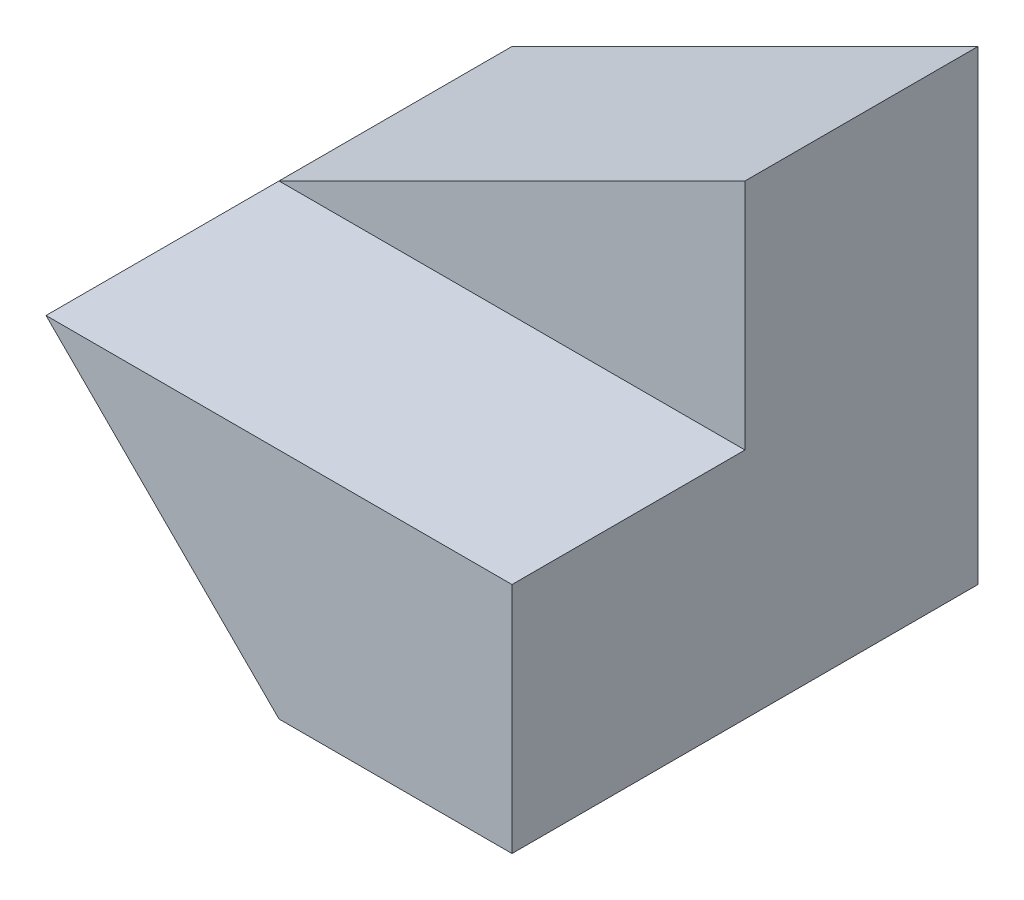
ISO-10303-21;
HEADER;
FILE_DESCRIPTION(('STEP AP214'),'2;1');
FILE_NAME('part.step','',(''),(''),'','','');
FILE_SCHEMA(('AUTOMOTIVE_DESIGN { 1 0 10303 214 1 1 1 1 }'));
ENDSEC;
DATA;
#1=APPLICATION_CONTEXT('core data for automotive mechanical design processes');
#2=APPLICATION_PROTOCOL_DEFINITION('international standard','automotive_design',2000,#1);
#3=PRODUCT_CONTEXT('',#1,'mechanical');
#4=PRODUCT('Part','Part','',(#3));
#5=PRODUCT_RELATED_PRODUCT_CATEGORY('part','',(#4));
#6=PRODUCT_DEFINITION_FORMATION('','',#4);
#7=PRODUCT_DEFINITION_CONTEXT('part definition',#1,'design');
#8=PRODUCT_DEFINITION('design','',#6,#7);
#9=PRODUCT_DEFINITION_SHAPE('','',#8);
#10=(LENGTH_UNIT() NAMED_UNIT(*) SI_UNIT(.MILLI.,.METRE.));
#11=(NAMED_UNIT(*) PLANE_ANGLE_UNIT() SI_UNIT($,.RADIAN.));
#12=(NAMED_UNIT(*) SI_UNIT($,.STERADIAN.) SOLID_ANGLE_UNIT());
#13=UNCERTAINTY_MEASURE_WITH_UNIT(LENGTH_MEASURE(1.E-05),#10,'distance_accuracy_value','');
#14=(GEOMETRIC_REPRESENTATION_CONTEXT(3) GLOBAL_UNCERTAINTY_ASSIGNED_CONTEXT((#13)) GLOBAL_UNIT_ASSIGNED_CONTEXT((#10,
#11,#12)) REPRESENTATION_CONTEXT('',''));
#15=CARTESIAN_POINT('',(0.,0.,0.));
#16=DIRECTION('',(0.,0.,1.));
#17=DIRECTION('',(1.,0.,0.));
#18=AXIS2_PLACEMENT_3D('',#15,#16,#17);
#19=CARTESIAN_POINT('',(0.,0.,40.));
#20=DIRECTION('',(1.,0.,0.));
#21=DIRECTION('',(0.,0.,-1.));
#22=AXIS2_PLACEMENT_3D('',#19,#20,#21);
#23=PLANE('',#22);
#24=DIRECTION('',(0.,-1.,0.));
#25=VECTOR('',#24,1.);
#26=CARTESIAN_POINT('',(0.,0.,20.));
#27=LINE('',#26,#25);
#28=CARTESIAN_POINT('',(0.,20.,20.));
#29=VERTEX_POINT('',#28);
#30=CARTESIAN_POINT('',(0.,0.,20.));
#31=VERTEX_POINT('',#30);
#32=EDGE_CURVE('E125',#29,#31,#27,.T.);
#33=ORIENTED_EDGE('',*,*,#32,.F.);
#34=DIRECTION('',(0.,0.,1.));
#35=VECTOR('',#34,1.);
#36=CARTESIAN_POINT('',(0.,20.,0.));
#37=LINE('',#36,#35);
#38=CARTESIAN_POINT('',(0.,20.,0.));
#39=VERTEX_POINT('',#38);
#40=EDGE_CURVE('E96',#39,#29,#37,.T.);
#41=ORIENTED_EDGE('',*,*,#40,.F.);
#42=DIRECTION('',(0.,-1.,0.));
#43=VECTOR('',#42,1.);
#44=CARTESIAN_POINT('',(0.,0.,0.));
#45=LINE('',#44,#43);
#46=CARTESIAN_POINT('',(0.,0.,0.));
#47=VERTEX_POINT('',#46);
#48=EDGE_CURVE('E73',#39,#47,#45,.T.);
#49=ORIENTED_EDGE('',*,*,#48,.T.);
#50=DIRECTION('',(0.,0.,-1.));
#51=VECTOR('',#50,1.);
#52=CARTESIAN_POINT('',(0.,0.,40.));
#53=LINE('',#52,#51);
#54=EDGE_CURVE('E41',#31,#47,#53,.T.);
#55=ORIENTED_EDGE('',*,*,#54,.F.);
#56=EDGE_LOOP('',(#33,#41,#49,#55));
#57=FACE_BOUND('',#56,.T.);
#58=ADVANCED_FACE('F33',(#57),#23,.F.);
#59=CARTESIAN_POINT('',(0.,0.,40.));
#60=DIRECTION('',(0.,1.,0.));
#61=DIRECTION('',(0.,0.,1.));
#62=AXIS2_PLACEMENT_3D('',#59,#60,#61);
#63=PLANE('',#62);
#64=DIRECTION('',(1.,0.,0.));
#65=VECTOR('',#64,1.);
#66=CARTESIAN_POINT('',(0.,0.,40.));
#67=LINE('',#66,#65);
#68=CARTESIAN_POINT('',(20.,0.,40.));
#69=VERTEX_POINT('',#68);
#70=CARTESIAN_POINT('',(40.,0.,40.));
#71=VERTEX_POINT('',#70);
#72=EDGE_CURVE('E48',#69,#71,#67,.T.);
#73=ORIENTED_EDGE('',*,*,#72,.F.);
#74=DIRECTION('',(0.,0.,1.));
#75=VECTOR('',#74,1.);
#76=CARTESIAN_POINT('',(20.,0.,20.));
#77=LINE('',#76,#75);
#78=CARTESIAN_POINT('',(20.,0.,20.));
#79=VERTEX_POINT('',#78);
#80=EDGE_CURVE('E116',#79,#69,#77,.T.);
#81=ORIENTED_EDGE('',*,*,#80,.F.);
#82=DIRECTION('',(1.,0.,0.));
#83=VECTOR('',#82,1.);
#84=CARTESIAN_POINT('',(20.,0.,20.));
#85=LINE('',#84,#83);
#86=EDGE_CURVE('E128',#31,#79,#85,.T.);
#87=ORIENTED_EDGE('',*,*,#86,.F.);
#88=ORIENTED_EDGE('',*,*,#54,.T.);
#89=DIRECTION('',(1.,0.,0.));
#90=VECTOR('',#89,1.);
#91=CARTESIAN_POINT('',(0.,0.,0.));
#92=LINE('',#91,#90);
#93=CARTESIAN_POINT('',(40.,0.,0.));
#94=VERTEX_POINT('',#93);
#95=EDGE_CURVE('E61',#47,#94,#92,.T.);
#96=ORIENTED_EDGE('',*,*,#95,.T.);
#97=DIRECTION('',(0.,0.,-1.));
#98=VECTOR('',#97,1.);
#99=CARTESIAN_POINT('',(40.,0.,40.));
#100=LINE('',#99,#98);
#101=EDGE_CURVE('E64',#71,#94,#100,.T.);
#102=ORIENTED_EDGE('',*,*,#101,.F.);
#103=EDGE_LOOP('',(#73,#81,#87,#88,#96,#102));
#104=FACE_BOUND('',#103,.T.);
#105=ADVANCED_FACE('F63',(#104),#63,.F.);
#106=CARTESIAN_POINT('',(40.,0.,40.));
#107=DIRECTION('',(-1.,0.,0.));
#108=DIRECTION('',(0.,0.,1.));
#109=AXIS2_PLACEMENT_3D('',#106,#107,#108);
#110=PLANE('',#109);
#111=DIRECTION('',(0.,0.,-1.));
#112=VECTOR('',#111,1.);
#113=CARTESIAN_POINT('',(40.,40.,40.));
#114=LINE('',#113,#112);
#115=CARTESIAN_POINT('',(40.,40.,20.));
#116=VERTEX_POINT('',#115);
#117=CARTESIAN_POINT('',(40.,40.,0.));
#118=VERTEX_POINT('',#117);
#119=EDGE_CURVE('E81',#116,#118,#114,.T.);
#120=ORIENTED_EDGE('',*,*,#119,.F.);
#121=DIRECTION('',(0.,1.,0.));
#122=VECTOR('',#121,1.);
#123=CARTESIAN_POINT('',(40.,40.,20.));
#124=LINE('',#123,#122);
#125=CARTESIAN_POINT('',(40.,20.,20.));
#126=VERTEX_POINT('',#125);
#127=EDGE_CURVE('E110',#126,#116,#124,.T.);
#128=ORIENTED_EDGE('',*,*,#127,.F.);
#129=DIRECTION('',(0.,0.,-1.));
#130=VECTOR('',#129,1.);
#131=CARTESIAN_POINT('',(40.,20.,40.));
#132=LINE('',#131,#130);
#133=CARTESIAN_POINT('',(40.,20.,40.));
#134=VERTEX_POINT('',#133);
#135=EDGE_CURVE('E113',#134,#126,#132,.T.);
#136=ORIENTED_EDGE('',*,*,#135,.F.);
#137=DIRECTION('',(0.,1.,0.));
#138=VECTOR('',#137,1.);
#139=CARTESIAN_POINT('',(40.,0.,40.));
#140=LINE('',#139,#138);
#141=EDGE_CURVE('E80',#71,#134,#140,.T.);
#142=ORIENTED_EDGE('',*,*,#141,.F.);
#143=ORIENTED_EDGE('',*,*,#101,.T.);
#144=DIRECTION('',(0.,1.,0.));
#145=VECTOR('',#144,1.);
#146=CARTESIAN_POINT('',(40.,0.,0.));
#147=LINE('',#146,#145);
#148=EDGE_CURVE('E72',#94,#118,#147,.T.);
#149=ORIENTED_EDGE('',*,*,#148,.T.);
#150=EDGE_LOOP('',(#120,#128,#136,#142,#143,#149));
#151=FACE_BOUND('',#150,.T.);
#152=ADVANCED_FACE('F78',(#151),#110,.F.);
#153=CARTESIAN_POINT('',(0.,0.,40.));
#154=DIRECTION('',(0.,0.,-1.));
#155=DIRECTION('',(-1.,0.,0.));
#156=AXIS2_PLACEMENT_3D('',#153,#154,#155);
#157=PLANE('',#156);
#158=DIRECTION('',(1.,0.,0.));
#159=VECTOR('',#158,1.);
#160=CARTESIAN_POINT('',(0.,20.,40.));
#161=LINE('',#160,#159);
#162=CARTESIAN_POINT('',(0.,20.,40.));
#163=VERTEX_POINT('',#162);
#164=EDGE_CURVE('E104',#163,#134,#161,.T.);
#165=ORIENTED_EDGE('',*,*,#164,.F.);
#166=DIRECTION('',(-0.707106781186548,0.707106781186547,0.));
#167=VECTOR('',#166,1.);
#168=CARTESIAN_POINT('',(0.,20.,40.));
#169=LINE('',#168,#167);
#170=EDGE_CURVE('E122',#69,#163,#169,.T.);
#171=ORIENTED_EDGE('',*,*,#170,.F.);
#172=ORIENTED_EDGE('',*,*,#72,.T.);
#173=ORIENTED_EDGE('',*,*,#141,.T.);
#174=EDGE_LOOP('',(#165,#171,#172,#173));
#175=FACE_BOUND('',#174,.T.);
#176=ADVANCED_FACE('F149',(#175),#157,.F.);
#177=CARTESIAN_POINT('',(0.,0.,0.));
#178=DIRECTION('',(0.,0.,-1.));
#179=DIRECTION('',(-1.,0.,0.));
#180=AXIS2_PLACEMENT_3D('',#177,#178,#179);
#181=PLANE('',#180);
#182=DIRECTION('',(0.894427190999916,0.447213595499958,0.));
#183=VECTOR('',#182,1.);
#184=CARTESIAN_POINT('',(0.,20.,0.));
#185=LINE('',#184,#183);
#186=EDGE_CURVE('E86',#39,#118,#185,.T.);
#187=ORIENTED_EDGE('',*,*,#186,.T.);
#188=ORIENTED_EDGE('',*,*,#148,.F.);
#189=ORIENTED_EDGE('',*,*,#95,.F.);
#190=ORIENTED_EDGE('',*,*,#48,.F.);
#191=EDGE_LOOP('',(#187,#188,#189,#190));
#192=FACE_BOUND('',#191,.T.);
#193=ADVANCED_FACE('F84',(#192),#181,.T.);
#194=CARTESIAN_POINT('',(0.,20.,0.));
#195=DIRECTION('',(0.447213595499958,-0.894427190999916,0.));
#196=DIRECTION('',(0.894427190999916,0.447213595499958,0.));
#197=AXIS2_PLACEMENT_3D('',#194,#195,#196);
#198=PLANE('',#197);
#199=ORIENTED_EDGE('',*,*,#40,.T.);
#200=DIRECTION('',(0.894427190999916,0.447213595499958,0.));
#201=VECTOR('',#200,1.);
#202=CARTESIAN_POINT('',(0.,20.,20.));
#203=LINE('',#202,#201);
#204=EDGE_CURVE('E11',#29,#116,#203,.T.);
#205=ORIENTED_EDGE('',*,*,#204,.T.);
#206=ORIENTED_EDGE('',*,*,#119,.T.);
#207=ORIENTED_EDGE('',*,*,#186,.F.);
#208=EDGE_LOOP('',(#199,#205,#206,#207));
#209=FACE_BOUND('',#208,.T.);
#210=ADVANCED_FACE('F154',(#209),#198,.F.);
#211=CARTESIAN_POINT('',(0.,40.,20.));
#212=DIRECTION('',(0.,0.,-1.));
#213=DIRECTION('',(0.,1.,0.));
#214=AXIS2_PLACEMENT_3D('',#211,#212,#213);
#215=PLANE('',#214);
#216=DIRECTION('',(1.,0.,0.));
#217=VECTOR('',#216,1.);
#218=CARTESIAN_POINT('',(0.,20.,20.));
#219=LINE('',#218,#217);
#220=EDGE_CURVE('E101',#29,#126,#219,.T.);
#221=ORIENTED_EDGE('',*,*,#220,.T.);
#222=ORIENTED_EDGE('',*,*,#127,.T.);
#223=ORIENTED_EDGE('',*,*,#204,.F.);
#224=EDGE_LOOP('',(#221,#222,#223));
#225=FACE_BOUND('',#224,.T.);
#226=ADVANCED_FACE('F159',(#225),#215,.F.);
#227=CARTESIAN_POINT('',(0.,20.,40.));
#228=DIRECTION('',(0.,-1.,0.));
#229=DIRECTION('',(0.,0.,-1.));
#230=AXIS2_PLACEMENT_3D('',#227,#228,#229);
#231=PLANE('',#230);
#232=ORIENTED_EDGE('',*,*,#135,.T.);
#233=ORIENTED_EDGE('',*,*,#220,.F.);
#234=DIRECTION('',(0.,0.,-1.));
#235=VECTOR('',#234,1.);
#236=CARTESIAN_POINT('',(0.,20.,40.));
#237=LINE('',#236,#235);
#238=EDGE_CURVE('E107',#163,#29,#237,.T.);
#239=ORIENTED_EDGE('',*,*,#238,.F.);
#240=ORIENTED_EDGE('',*,*,#164,.T.);
#241=EDGE_LOOP('',(#232,#233,#239,#240));
#242=FACE_BOUND('',#241,.T.);
#243=ADVANCED_FACE('F160',(#242),#231,.F.);
#244=CARTESIAN_POINT('',(0.,20.,20.));
#245=DIRECTION('',(0.707106781186547,0.707106781186548,0.));
#246=DIRECTION('',(-0.707106781186548,0.707106781186547,0.));
#247=AXIS2_PLACEMENT_3D('',#244,#245,#246);
#248=PLANE('',#247);
#249=ORIENTED_EDGE('',*,*,#170,.T.);
#250=ORIENTED_EDGE('',*,*,#238,.T.);
#251=DIRECTION('',(-0.707106781186548,0.707106781186547,0.));
#252=VECTOR('',#251,1.);
#253=CARTESIAN_POINT('',(0.,20.,20.));
#254=LINE('',#253,#252);
#255=EDGE_CURVE('E121',#79,#29,#254,.T.);
#256=ORIENTED_EDGE('',*,*,#255,.F.);
#257=ORIENTED_EDGE('',*,*,#80,.T.);
#258=EDGE_LOOP('',(#249,#250,#256,#257));
#259=FACE_BOUND('',#258,.T.);
#260=ADVANCED_FACE('F163',(#259),#248,.F.);
#261=CARTESIAN_POINT('',(0.,0.,20.));
#262=DIRECTION('',(0.,0.,1.));
#263=DIRECTION('',(1.,0.,0.));
#264=AXIS2_PLACEMENT_3D('',#261,#262,#263);
#265=PLANE('',#264);
#266=ORIENTED_EDGE('',*,*,#32,.T.);
#267=ORIENTED_EDGE('',*,*,#86,.T.);
#268=ORIENTED_EDGE('',*,*,#255,.T.);
#269=EDGE_LOOP('',(#266,#267,#268));
#270=FACE_BOUND('',#269,.T.);
#271=ADVANCED_FACE('F135',(#270),#265,.T.);
#272=CLOSED_SHELL('',(#58,#105,#152,#176,#193,#210,#226,#243,#260,#271));
#273=MANIFOLD_SOLID_BREP('B2',#272);
#274=ADVANCED_BREP_SHAPE_REPRESENTATION('',(#18,#273),#14);
#275=SHAPE_DEFINITION_REPRESENTATION(#9,#274);
ENDSEC;
END-ISO-10303-21;
